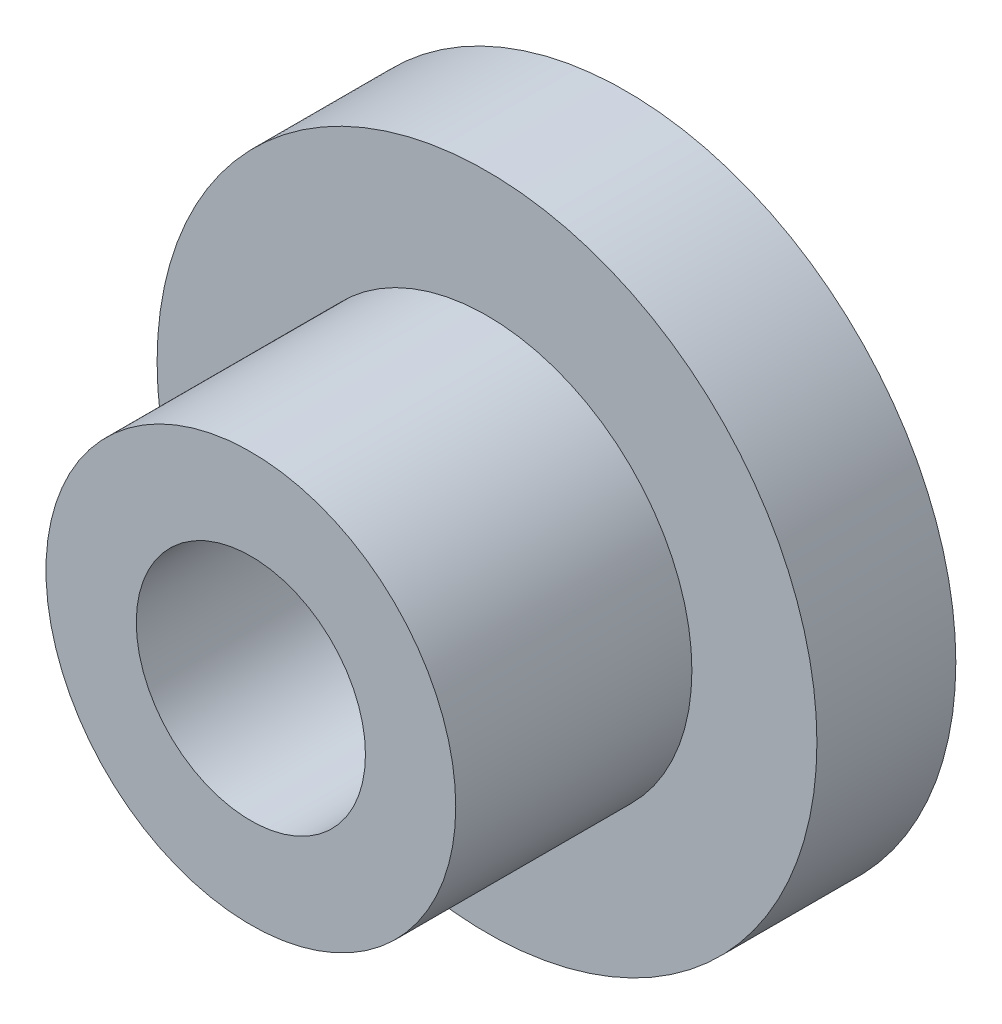
ISO-10303-21;
HEADER;
FILE_DESCRIPTION(('STEP AP214'),'2;1');
FILE_NAME('part.step','',(''),(''),'','','');
FILE_SCHEMA(('AUTOMOTIVE_DESIGN { 1 0 10303 214 1 1 1 1 }'));
ENDSEC;
DATA;
#1=APPLICATION_CONTEXT('core data for automotive mechanical design processes');
#2=APPLICATION_PROTOCOL_DEFINITION('international standard','automotive_design',2000,#1);
#3=PRODUCT_CONTEXT('',#1,'mechanical');
#4=PRODUCT('Part','Part','',(#3));
#5=PRODUCT_RELATED_PRODUCT_CATEGORY('part','',(#4));
#6=PRODUCT_DEFINITION_FORMATION('','',#4);
#7=PRODUCT_DEFINITION_CONTEXT('part definition',#1,'design');
#8=PRODUCT_DEFINITION('design','',#6,#7);
#9=PRODUCT_DEFINITION_SHAPE('','',#8);
#10=(LENGTH_UNIT() NAMED_UNIT(*) SI_UNIT(.MILLI.,.METRE.));
#11=(NAMED_UNIT(*) PLANE_ANGLE_UNIT() SI_UNIT($,.RADIAN.));
#12=(NAMED_UNIT(*) SI_UNIT($,.STERADIAN.) SOLID_ANGLE_UNIT());
#13=UNCERTAINTY_MEASURE_WITH_UNIT(LENGTH_MEASURE(1.E-05),#10,'distance_accuracy_value','');
#14=(GEOMETRIC_REPRESENTATION_CONTEXT(3) GLOBAL_UNCERTAINTY_ASSIGNED_CONTEXT((#13)) GLOBAL_UNIT_ASSIGNED_CONTEXT((#10,
#11,#12)) REPRESENTATION_CONTEXT('',''));
#15=CARTESIAN_POINT('',(0.,0.,0.));
#16=DIRECTION('',(0.,0.,1.));
#17=DIRECTION('',(1.,0.,0.));
#18=AXIS2_PLACEMENT_3D('',#15,#16,#17);
#19=CARTESIAN_POINT('',(0.,0.,0.));
#20=DIRECTION('',(0.,0.,1.));
#21=DIRECTION('',(1.,0.,0.));
#22=AXIS2_PLACEMENT_3D('',#19,#20,#21);
#23=PLANE('',#22);
#24=CARTESIAN_POINT('',(0.,0.,0.));
#25=DIRECTION('',(0.,0.,1.));
#26=DIRECTION('',(1.,0.,0.));
#27=AXIS2_PLACEMENT_3D('',#24,#25,#26);
#28=CIRCLE('',#27,1.65);
#29=CARTESIAN_POINT('',(1.65,0.,0.));
#30=VERTEX_POINT('',#29);
#31=EDGE_CURVE('E55',#30,#30,#28,.T.);
#32=ORIENTED_EDGE('',*,*,#31,.T.);
#33=EDGE_LOOP('',(#32));
#34=FACE_BOUND('',#33,.T.);
#35=CARTESIAN_POINT('',(0.,0.,0.));
#36=DIRECTION('',(0.,0.,1.));
#37=DIRECTION('',(1.,0.,0.));
#38=AXIS2_PLACEMENT_3D('',#35,#36,#37);
#39=CIRCLE('',#38,4.75);
#40=CARTESIAN_POINT('',(4.75,0.,0.));
#41=VERTEX_POINT('',#40);
#42=EDGE_CURVE('E10',#41,#41,#39,.T.);
#43=ORIENTED_EDGE('',*,*,#42,.F.);
#44=EDGE_LOOP('',(#43));
#45=FACE_BOUND('',#44,.T.);
#46=ADVANCED_FACE('F36',(#34,#45),#23,.F.);
#47=CARTESIAN_POINT('',(0.,0.,90.1443204284266));
#48=DIRECTION('',(0.,0.,1.));
#49=DIRECTION('',(1.,0.,0.));
#50=AXIS2_PLACEMENT_3D('',#47,#48,#49);
#51=CYLINDRICAL_SURFACE('',#50,4.75);
#52=CARTESIAN_POINT('',(0.,0.,2.));
#53=DIRECTION('',(0.,0.,1.));
#54=DIRECTION('',(1.,0.,0.));
#55=AXIS2_PLACEMENT_3D('',#52,#53,#54);
#56=CIRCLE('',#55,4.75);
#57=CARTESIAN_POINT('',(4.75,0.,2.));
#58=VERTEX_POINT('',#57);
#59=EDGE_CURVE('E42',#58,#58,#56,.T.);
#60=ORIENTED_EDGE('',*,*,#59,.F.);
#61=EDGE_LOOP('',(#60));
#62=FACE_BOUND('',#61,.T.);
#63=ORIENTED_EDGE('',*,*,#42,.T.);
#64=EDGE_LOOP('',(#63));
#65=FACE_BOUND('',#64,.T.);
#66=ADVANCED_FACE('F78',(#62,#65),#51,.T.);
#67=CARTESIAN_POINT('',(0.,4.75,2.));
#68=DIRECTION('',(0.,0.,-1.));
#69=DIRECTION('',(-1.,0.,0.));
#70=AXIS2_PLACEMENT_3D('',#67,#68,#69);
#71=PLANE('',#70);
#72=CARTESIAN_POINT('',(0.,0.,2.));
#73=DIRECTION('',(0.,0.,1.));
#74=DIRECTION('',(1.,0.,0.));
#75=AXIS2_PLACEMENT_3D('',#72,#73,#74);
#76=CIRCLE('',#75,2.95);
#77=CARTESIAN_POINT('',(2.95,0.,2.));
#78=VERTEX_POINT('',#77);
#79=EDGE_CURVE('E46',#78,#78,#76,.T.);
#80=ORIENTED_EDGE('',*,*,#79,.F.);
#81=EDGE_LOOP('',(#80));
#82=FACE_BOUND('',#81,.T.);
#83=ORIENTED_EDGE('',*,*,#59,.T.);
#84=EDGE_LOOP('',(#83));
#85=FACE_BOUND('',#84,.T.);
#86=ADVANCED_FACE('F73',(#82,#85),#71,.F.);
#87=CARTESIAN_POINT('',(0.,0.,90.1443204284266));
#88=DIRECTION('',(0.,0.,1.));
#89=DIRECTION('',(1.,0.,0.));
#90=AXIS2_PLACEMENT_3D('',#87,#88,#89);
#91=CYLINDRICAL_SURFACE('',#90,2.95);
#92=CARTESIAN_POINT('',(0.,0.,5.4));
#93=DIRECTION('',(0.,0.,1.));
#94=DIRECTION('',(1.,0.,0.));
#95=AXIS2_PLACEMENT_3D('',#92,#93,#94);
#96=CIRCLE('',#95,2.95);
#97=CARTESIAN_POINT('',(2.95,0.,5.4));
#98=VERTEX_POINT('',#97);
#99=EDGE_CURVE('E50',#98,#98,#96,.T.);
#100=ORIENTED_EDGE('',*,*,#99,.F.);
#101=EDGE_LOOP('',(#100));
#102=FACE_BOUND('',#101,.T.);
#103=ORIENTED_EDGE('',*,*,#79,.T.);
#104=EDGE_LOOP('',(#103));
#105=FACE_BOUND('',#104,.T.);
#106=ADVANCED_FACE('F67',(#102,#105),#91,.T.);
#107=CARTESIAN_POINT('',(0.,2.95,5.4));
#108=DIRECTION('',(0.,0.,-1.));
#109=DIRECTION('',(-1.,0.,0.));
#110=AXIS2_PLACEMENT_3D('',#107,#108,#109);
#111=PLANE('',#110);
#112=CARTESIAN_POINT('',(0.,0.,5.4));
#113=DIRECTION('',(0.,0.,1.));
#114=DIRECTION('',(1.,0.,0.));
#115=AXIS2_PLACEMENT_3D('',#112,#113,#114);
#116=CIRCLE('',#115,1.65);
#117=CARTESIAN_POINT('',(1.65,0.,5.4));
#118=VERTEX_POINT('',#117);
#119=EDGE_CURVE('E58',#118,#118,#116,.T.);
#120=ORIENTED_EDGE('',*,*,#119,.F.);
#121=EDGE_LOOP('',(#120));
#122=FACE_BOUND('',#121,.T.);
#123=ORIENTED_EDGE('',*,*,#99,.T.);
#124=EDGE_LOOP('',(#123));
#125=FACE_BOUND('',#124,.T.);
#126=ADVANCED_FACE('F64',(#122,#125),#111,.F.);
#127=CARTESIAN_POINT('',(0.,0.,5.4));
#128=DIRECTION('',(0.,0.,1.));
#129=DIRECTION('',(1.,0.,0.));
#130=AXIS2_PLACEMENT_3D('',#127,#128,#129);
#131=CYLINDRICAL_SURFACE('',#130,1.65);
#132=ORIENTED_EDGE('',*,*,#31,.F.);
#133=EDGE_LOOP('',(#132));
#134=FACE_BOUND('',#133,.T.);
#135=ORIENTED_EDGE('',*,*,#119,.T.);
#136=EDGE_LOOP('',(#135));
#137=FACE_BOUND('',#136,.T.);
#138=ADVANCED_FACE('F62',(#134,#137),#131,.F.);
#139=CLOSED_SHELL('',(#46,#66,#86,#106,#126,#138));
#140=MANIFOLD_SOLID_BREP('B2',#139);
#141=ADVANCED_BREP_SHAPE_REPRESENTATION('',(#18,#140),#14);
#142=SHAPE_DEFINITION_REPRESENTATION(#9,#141);
ENDSEC;
END-ISO-10303-21;
